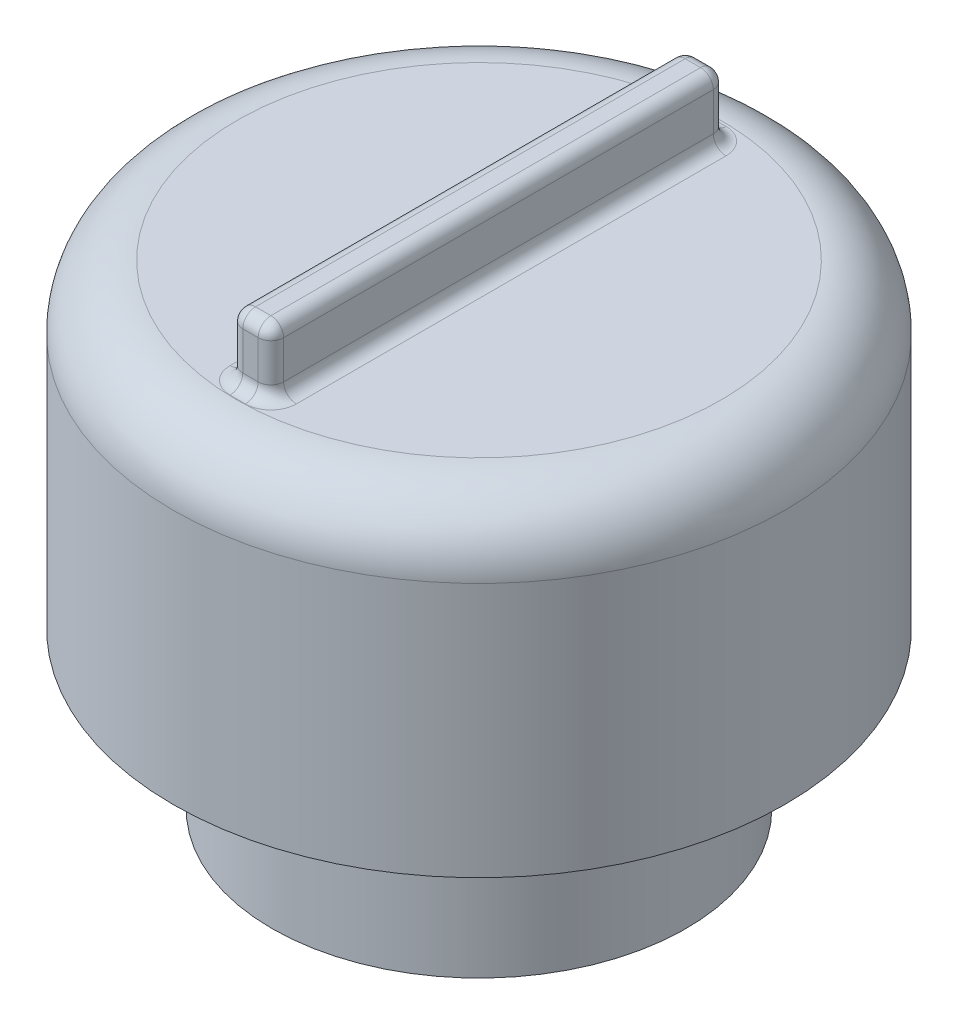
ISO-10303-21;
HEADER;
FILE_DESCRIPTION(('STEP AP214'),'2;1');
FILE_NAME('part.step','',(''),(''),'','','');
FILE_SCHEMA(('AUTOMOTIVE_DESIGN { 1 0 10303 214 1 1 1 1 }'));
ENDSEC;
DATA;
#1=APPLICATION_CONTEXT('core data for automotive mechanical design processes');
#2=APPLICATION_PROTOCOL_DEFINITION('international standard','automotive_design',2000,#1);
#3=PRODUCT_CONTEXT('',#1,'mechanical');
#4=PRODUCT('Part','Part','',(#3));
#5=PRODUCT_RELATED_PRODUCT_CATEGORY('part','',(#4));
#6=PRODUCT_DEFINITION_FORMATION('','',#4);
#7=PRODUCT_DEFINITION_CONTEXT('part definition',#1,'design');
#8=PRODUCT_DEFINITION('design','',#6,#7);
#9=PRODUCT_DEFINITION_SHAPE('','',#8);
#10=(LENGTH_UNIT() NAMED_UNIT(*) SI_UNIT(.MILLI.,.METRE.));
#11=(NAMED_UNIT(*) PLANE_ANGLE_UNIT() SI_UNIT($,.RADIAN.));
#12=(NAMED_UNIT(*) SI_UNIT($,.STERADIAN.) SOLID_ANGLE_UNIT());
#13=UNCERTAINTY_MEASURE_WITH_UNIT(LENGTH_MEASURE(1.E-05),#10,'distance_accuracy_value','');
#14=(GEOMETRIC_REPRESENTATION_CONTEXT(3) GLOBAL_UNCERTAINTY_ASSIGNED_CONTEXT((#13)) GLOBAL_UNIT_ASSIGNED_CONTEXT((#10,
#11,#12)) REPRESENTATION_CONTEXT('',''));
#15=CARTESIAN_POINT('',(0.,0.,0.));
#16=DIRECTION('',(0.,0.,1.));
#17=DIRECTION('',(1.,0.,0.));
#18=AXIS2_PLACEMENT_3D('',#15,#16,#17);
#19=CARTESIAN_POINT('',(0.,7.46,0.));
#20=DIRECTION('',(0.,1.,0.));
#21=DIRECTION('',(0.,0.,1.));
#22=AXIS2_PLACEMENT_3D('',#19,#20,#21);
#23=PLANE('',#22);
#24=CARTESIAN_POINT('',(0.,7.46,0.));
#25=DIRECTION('',(0.,1.,0.));
#26=DIRECTION('',(0.,0.,1.));
#27=AXIS2_PLACEMENT_3D('',#24,#25,#26);
#28=CIRCLE('',#27,3.8);
#29=CARTESIAN_POINT('',(0.,7.46,3.8));
#30=VERTEX_POINT('',#29);
#31=EDGE_CURVE('E72',#30,#30,#28,.T.);
#32=ORIENTED_EDGE('',*,*,#31,.T.);
#33=EDGE_LOOP('',(#32));
#34=FACE_BOUND('',#33,.T.);
#35=CARTESIAN_POINT('',(0.120552884615385,7.46,-3.35686063388664));
#36=DIRECTION('',(0.,1.,0.));
#37=DIRECTION('',(0.,0.,1.));
#38=AXIS2_PLACEMENT_3D('',#35,#36,#37);
#39=CIRCLE('',#38,0.4);
#40=CARTESIAN_POINT('',(0.520552884615385,7.46,-3.35686063388664));
#41=VERTEX_POINT('',#40);
#42=CARTESIAN_POINT('',(0.120552884615385,7.46,-3.75686063388664));
#43=VERTEX_POINT('',#42);
#44=EDGE_CURVE('E207',#41,#43,#39,.T.);
#45=ORIENTED_EDGE('',*,*,#44,.F.);
#46=DIRECTION('',(0.,0.,1.));
#47=VECTOR('',#46,1.);
#48=CARTESIAN_POINT('',(0.520552884615385,7.46,3.58688936611336));
#49=LINE('',#48,#47);
#50=CARTESIAN_POINT('',(0.520552884615385,7.46,3.38688936611336));
#51=VERTEX_POINT('',#50);
#52=EDGE_CURVE('E199',#41,#51,#49,.T.);
#53=ORIENTED_EDGE('',*,*,#52,.T.);
#54=CARTESIAN_POINT('',(0.120552884615385,7.46,3.38688936611336));
#55=DIRECTION('',(0.,1.,0.));
#56=DIRECTION('',(0.,0.,1.));
#57=AXIS2_PLACEMENT_3D('',#54,#55,#56);
#58=CIRCLE('',#57,0.4);
#59=CARTESIAN_POINT('',(0.120552884615385,7.46,3.78688936611336));
#60=VERTEX_POINT('',#59);
#61=EDGE_CURVE('E193',#60,#51,#58,.T.);
#62=ORIENTED_EDGE('',*,*,#61,.F.);
#63=DIRECTION('',(-1.,0.,0.));
#64=VECTOR('',#63,1.);
#65=CARTESIAN_POINT('',(-0.320552884615384,7.46,3.78688936611336));
#66=LINE('',#65,#64);
#67=CARTESIAN_POINT('',(-0.120552884615384,7.46,3.78688936611336));
#68=VERTEX_POINT('',#67);
#69=EDGE_CURVE('E194',#60,#68,#66,.T.);
#70=ORIENTED_EDGE('',*,*,#69,.T.);
#71=CARTESIAN_POINT('',(-0.120552884615384,7.46,3.38688936611336));
#72=DIRECTION('',(0.,1.,0.));
#73=DIRECTION('',(0.,0.,1.));
#74=AXIS2_PLACEMENT_3D('',#71,#72,#73);
#75=CIRCLE('',#74,0.4);
#76=CARTESIAN_POINT('',(-0.520552884615384,7.46,3.38688936611336));
#77=VERTEX_POINT('',#76);
#78=EDGE_CURVE('E201',#77,#68,#75,.T.);
#79=ORIENTED_EDGE('',*,*,#78,.F.);
#80=DIRECTION('',(0.,0.,-1.));
#81=VECTOR('',#80,1.);
#82=CARTESIAN_POINT('',(-0.520552884615384,7.46,-3.55686063388664));
#83=LINE('',#82,#81);
#84=CARTESIAN_POINT('',(-0.520552884615384,7.46,-3.35686063388664));
#85=VERTEX_POINT('',#84);
#86=EDGE_CURVE('E170',#77,#85,#83,.T.);
#87=ORIENTED_EDGE('',*,*,#86,.T.);
#88=CARTESIAN_POINT('',(-0.120552884615384,7.46,-3.35686063388664));
#89=DIRECTION('',(0.,1.,0.));
#90=DIRECTION('',(0.,0.,1.));
#91=AXIS2_PLACEMENT_3D('',#88,#89,#90);
#92=CIRCLE('',#91,0.4);
#93=CARTESIAN_POINT('',(-0.120552884615384,7.46,-3.75686063388664));
#94=VERTEX_POINT('',#93);
#95=EDGE_CURVE('E165',#94,#85,#92,.T.);
#96=ORIENTED_EDGE('',*,*,#95,.F.);
#97=DIRECTION('',(1.,0.,0.));
#98=VECTOR('',#97,1.);
#99=CARTESIAN_POINT('',(0.320552884615385,7.46,-3.75686063388664));
#100=LINE('',#99,#98);
#101=EDGE_CURVE('E168',#94,#43,#100,.T.);
#102=ORIENTED_EDGE('',*,*,#101,.T.);
#103=EDGE_LOOP('',(#45,#53,#62,#70,#79,#87,#96,#102));
#104=FACE_BOUND('',#103,.T.);
#105=ADVANCED_FACE('F63',(#34,#104),#23,.T.);
#106=CARTESIAN_POINT('',(0.,2.46,0.));
#107=DIRECTION('',(0.,-1.,0.));
#108=DIRECTION('',(0.,0.,-1.));
#109=AXIS2_PLACEMENT_3D('',#106,#107,#108);
#110=CYLINDRICAL_SURFACE('',#109,3.25);
#111=CARTESIAN_POINT('',(0.,2.46,0.));
#112=DIRECTION('',(0.,1.,0.));
#113=DIRECTION('',(0.,0.,1.));
#114=AXIS2_PLACEMENT_3D('',#111,#112,#113);
#115=CIRCLE('',#114,3.25);
#116=CARTESIAN_POINT('',(0.,2.46,3.25));
#117=VERTEX_POINT('',#116);
#118=EDGE_CURVE('E175',#117,#117,#115,.T.);
#119=ORIENTED_EDGE('',*,*,#118,.F.);
#120=EDGE_LOOP('',(#119));
#121=FACE_BOUND('',#120,.T.);
#122=CARTESIAN_POINT('',(0.,0.,0.));
#123=DIRECTION('',(0.,1.,0.));
#124=DIRECTION('',(0.,0.,1.));
#125=AXIS2_PLACEMENT_3D('',#122,#123,#124);
#126=CIRCLE('',#125,3.25);
#127=CARTESIAN_POINT('',(0.,0.,3.25));
#128=VERTEX_POINT('',#127);
#129=EDGE_CURVE('E519',#128,#128,#126,.T.);
#130=ORIENTED_EDGE('',*,*,#129,.T.);
#131=EDGE_LOOP('',(#130));
#132=FACE_BOUND('',#131,.T.);
#133=ADVANCED_FACE('F371',(#121,#132),#110,.T.);
#134=CARTESIAN_POINT('',(0.,0.,0.));
#135=DIRECTION('',(0.,1.,0.));
#136=DIRECTION('',(0.,0.,1.));
#137=AXIS2_PLACEMENT_3D('',#134,#135,#136);
#138=PLANE('',#137);
#139=CARTESIAN_POINT('',(0.,0.,0.));
#140=DIRECTION('',(0.,-1.,0.));
#141=DIRECTION('',(0.,0.,-1.));
#142=AXIS2_PLACEMENT_3D('',#139,#140,#141);
#143=CIRCLE('',#142,1.75);
#144=CARTESIAN_POINT('',(0.,0.,-1.75));
#145=VERTEX_POINT('',#144);
#146=EDGE_CURVE('E523',#145,#145,#143,.T.);
#147=ORIENTED_EDGE('',*,*,#146,.F.);
#148=EDGE_LOOP('',(#147));
#149=FACE_BOUND('',#148,.T.);
#150=ORIENTED_EDGE('',*,*,#129,.F.);
#151=EDGE_LOOP('',(#150));
#152=FACE_BOUND('',#151,.T.);
#153=ADVANCED_FACE('F376',(#149,#152),#138,.F.);
#154=CARTESIAN_POINT('',(0.,2.5,0.));
#155=DIRECTION('',(0.,-1.,0.));
#156=DIRECTION('',(0.,0.,-1.));
#157=AXIS2_PLACEMENT_3D('',#154,#155,#156);
#158=CYLINDRICAL_SURFACE('',#157,1.75);
#159=CARTESIAN_POINT('',(0.,2.46,0.));
#160=DIRECTION('',(0.,1.,0.));
#161=DIRECTION('',(0.,0.,1.));
#162=AXIS2_PLACEMENT_3D('',#159,#160,#161);
#163=CIRCLE('',#162,1.75);
#164=CARTESIAN_POINT('',(0.,2.46,1.75));
#165=VERTEX_POINT('',#164);
#166=EDGE_CURVE('E527',#165,#165,#163,.T.);
#167=ORIENTED_EDGE('',*,*,#166,.T.);
#168=EDGE_LOOP('',(#167));
#169=FACE_BOUND('',#168,.T.);
#170=ORIENTED_EDGE('',*,*,#146,.T.);
#171=EDGE_LOOP('',(#170));
#172=FACE_BOUND('',#171,.T.);
#173=ADVANCED_FACE('F387',(#169,#172),#158,.F.);
#174=CARTESIAN_POINT('',(0.,2.46,0.));
#175=DIRECTION('',(0.,1.,0.));
#176=DIRECTION('',(0.,0.,1.));
#177=AXIS2_PLACEMENT_3D('',#174,#175,#176);
#178=PLANE('',#177);
#179=ORIENTED_EDGE('',*,*,#118,.T.);
#180=EDGE_LOOP('',(#179));
#181=FACE_BOUND('',#180,.T.);
#182=CARTESIAN_POINT('',(0.,2.46,0.));
#183=DIRECTION('',(0.,1.,0.));
#184=DIRECTION('',(0.,0.,1.));
#185=AXIS2_PLACEMENT_3D('',#182,#183,#184);
#186=CIRCLE('',#185,4.8);
#187=CARTESIAN_POINT('',(0.,2.46,4.8));
#188=VERTEX_POINT('',#187);
#189=EDGE_CURVE('E355',#188,#188,#186,.T.);
#190=ORIENTED_EDGE('',*,*,#189,.F.);
#191=EDGE_LOOP('',(#190));
#192=FACE_BOUND('',#191,.T.);
#193=ADVANCED_FACE('F383',(#181,#192),#178,.F.);
#194=CARTESIAN_POINT('',(0.,7.46,0.));
#195=DIRECTION('',(0.,-1.,0.));
#196=DIRECTION('',(0.,0.,-1.));
#197=AXIS2_PLACEMENT_3D('',#194,#195,#196);
#198=CYLINDRICAL_SURFACE('',#197,4.8);
#199=CARTESIAN_POINT('',(0.,6.46,0.));
#200=DIRECTION('',(0.,1.,0.));
#201=DIRECTION('',(0.,0.,1.));
#202=AXIS2_PLACEMENT_3D('',#199,#200,#201);
#203=CIRCLE('',#202,4.8);
#204=CARTESIAN_POINT('',(0.,6.46,4.8));
#205=VERTEX_POINT('',#204);
#206=EDGE_CURVE('E12',#205,#205,#203,.F.);
#207=ORIENTED_EDGE('',*,*,#206,.T.);
#208=EDGE_LOOP('',(#207));
#209=FACE_BOUND('',#208,.T.);
#210=ORIENTED_EDGE('',*,*,#189,.T.);
#211=EDGE_LOOP('',(#210));
#212=FACE_BOUND('',#211,.T.);
#213=ADVANCED_FACE('F386',(#209,#212),#198,.T.);
#214=ORIENTED_EDGE('',*,*,#166,.F.);
#215=EDGE_LOOP('',(#214));
#216=FACE_BOUND('',#215,.T.);
#217=ADVANCED_FACE('F389',(#216),#178,.F.);
#218=CARTESIAN_POINT('',(-0.320552884615384,8.46,3.58688936611336));
#219=DIRECTION('',(-1.,0.,0.));
#220=DIRECTION('',(0.,0.,1.));
#221=AXIS2_PLACEMENT_3D('',#218,#219,#220);
#222=PLANE('',#221);
#223=DIRECTION('',(0.,0.,-1.));
#224=VECTOR('',#223,1.);
#225=CARTESIAN_POINT('',(-0.320552884615384,7.66,3.58688936611336));
#226=LINE('',#225,#224);
#227=CARTESIAN_POINT('',(-0.320552884615384,7.66,-3.35686063388664));
#228=VERTEX_POINT('',#227);
#229=CARTESIAN_POINT('',(-0.320552884615384,7.66,3.38688936611336));
#230=VERTEX_POINT('',#229);
#231=EDGE_CURVE('E236',#228,#230,#226,.F.);
#232=ORIENTED_EDGE('',*,*,#231,.T.);
#233=DIRECTION('',(0.,-1.,0.));
#234=VECTOR('',#233,1.);
#235=CARTESIAN_POINT('',(-0.320552884615384,8.46,3.38688936611336));
#236=LINE('',#235,#234);
#237=CARTESIAN_POINT('',(-0.320552884615384,8.26,3.38688936611336));
#238=VERTEX_POINT('',#237);
#239=EDGE_CURVE('E245',#230,#238,#236,.F.);
#240=ORIENTED_EDGE('',*,*,#239,.T.);
#241=DIRECTION('',(0.,0.,-1.));
#242=VECTOR('',#241,1.);
#243=CARTESIAN_POINT('',(-0.320552884615384,8.26,-3.55686063388664));
#244=LINE('',#243,#242);
#245=CARTESIAN_POINT('',(-0.320552884615384,8.26,-3.35686063388664));
#246=VERTEX_POINT('',#245);
#247=EDGE_CURVE('E242',#238,#246,#244,.T.);
#248=ORIENTED_EDGE('',*,*,#247,.T.);
#249=DIRECTION('',(0.,-1.,0.));
#250=VECTOR('',#249,1.);
#251=CARTESIAN_POINT('',(-0.320552884615384,8.46,-3.35686063388664));
#252=LINE('',#251,#250);
#253=EDGE_CURVE('E239',#246,#228,#252,.T.);
#254=ORIENTED_EDGE('',*,*,#253,.T.);
#255=EDGE_LOOP('',(#232,#240,#248,#254));
#256=FACE_BOUND('',#255,.T.);
#257=ADVANCED_FACE('F381',(#256),#222,.T.);
#258=CARTESIAN_POINT('',(0.320552884615385,8.46,3.58688936611336));
#259=DIRECTION('',(0.,0.,1.));
#260=DIRECTION('',(1.,0.,0.));
#261=AXIS2_PLACEMENT_3D('',#258,#259,#260);
#262=PLANE('',#261);
#263=DIRECTION('',(-1.,0.,0.));
#264=VECTOR('',#263,1.);
#265=CARTESIAN_POINT('',(-0.320552884615384,8.26,3.58688936611336));
#266=LINE('',#265,#264);
#267=CARTESIAN_POINT('',(0.120552884615385,8.26,3.58688936611336));
#268=VERTEX_POINT('',#267);
#269=CARTESIAN_POINT('',(-0.120552884615384,8.26,3.58688936611336));
#270=VERTEX_POINT('',#269);
#271=EDGE_CURVE('E223',#268,#270,#266,.T.);
#272=ORIENTED_EDGE('',*,*,#271,.T.);
#273=DIRECTION('',(0.,-1.,0.));
#274=VECTOR('',#273,1.);
#275=CARTESIAN_POINT('',(-0.120552884615384,8.46,3.58688936611336));
#276=LINE('',#275,#274);
#277=CARTESIAN_POINT('',(-0.120552884615384,7.66,3.58688936611336));
#278=VERTEX_POINT('',#277);
#279=EDGE_CURVE('E232',#270,#278,#276,.T.);
#280=ORIENTED_EDGE('',*,*,#279,.T.);
#281=DIRECTION('',(-1.,0.,0.));
#282=VECTOR('',#281,1.);
#283=CARTESIAN_POINT('',(0.320552884615385,7.66,3.58688936611336));
#284=LINE('',#283,#282);
#285=CARTESIAN_POINT('',(0.120552884615385,7.66,3.58688936611336));
#286=VERTEX_POINT('',#285);
#287=EDGE_CURVE('E229',#278,#286,#284,.F.);
#288=ORIENTED_EDGE('',*,*,#287,.T.);
#289=DIRECTION('',(0.,-1.,0.));
#290=VECTOR('',#289,1.);
#291=CARTESIAN_POINT('',(0.120552884615385,8.46,3.58688936611336));
#292=LINE('',#291,#290);
#293=EDGE_CURVE('E226',#286,#268,#292,.F.);
#294=ORIENTED_EDGE('',*,*,#293,.T.);
#295=EDGE_LOOP('',(#272,#280,#288,#294));
#296=FACE_BOUND('',#295,.T.);
#297=ADVANCED_FACE('F484',(#296),#262,.T.);
#298=CARTESIAN_POINT('',(0.320552884615385,8.46,-3.55686063388664));
#299=DIRECTION('',(1.,0.,0.));
#300=DIRECTION('',(0.,0.,-1.));
#301=AXIS2_PLACEMENT_3D('',#298,#299,#300);
#302=PLANE('',#301);
#303=DIRECTION('',(0.,-1.,0.));
#304=VECTOR('',#303,1.);
#305=CARTESIAN_POINT('',(0.320552884615385,8.46,3.38688936611336));
#306=LINE('',#305,#304);
#307=CARTESIAN_POINT('',(0.320552884615385,8.26,3.38688936611336));
#308=VERTEX_POINT('',#307);
#309=CARTESIAN_POINT('',(0.320552884615385,7.66,3.38688936611336));
#310=VERTEX_POINT('',#309);
#311=EDGE_CURVE('E255',#308,#310,#306,.T.);
#312=ORIENTED_EDGE('',*,*,#311,.T.);
#313=DIRECTION('',(0.,0.,1.));
#314=VECTOR('',#313,1.);
#315=CARTESIAN_POINT('',(0.320552884615385,7.66,-3.55686063388664));
#316=LINE('',#315,#314);
#317=CARTESIAN_POINT('',(0.320552884615385,7.66,-3.35686063388664));
#318=VERTEX_POINT('',#317);
#319=EDGE_CURVE('E259',#310,#318,#316,.F.);
#320=ORIENTED_EDGE('',*,*,#319,.T.);
#321=DIRECTION('',(0.,-1.,0.));
#322=VECTOR('',#321,1.);
#323=CARTESIAN_POINT('',(0.320552884615385,8.46,-3.35686063388664));
#324=LINE('',#323,#322);
#325=CARTESIAN_POINT('',(0.320552884615385,8.26,-3.35686063388664));
#326=VERTEX_POINT('',#325);
#327=EDGE_CURVE('E252',#318,#326,#324,.F.);
#328=ORIENTED_EDGE('',*,*,#327,.T.);
#329=DIRECTION('',(0.,0.,1.));
#330=VECTOR('',#329,1.);
#331=CARTESIAN_POINT('',(0.320552884615385,8.26,3.58688936611336));
#332=LINE('',#331,#330);
#333=EDGE_CURVE('E249',#326,#308,#332,.T.);
#334=ORIENTED_EDGE('',*,*,#333,.T.);
#335=EDGE_LOOP('',(#312,#320,#328,#334));
#336=FACE_BOUND('',#335,.T.);
#337=ADVANCED_FACE('F497',(#336),#302,.T.);
#338=CARTESIAN_POINT('',(-0.320552884615384,8.46,-3.55686063388664));
#339=DIRECTION('',(0.,0.,-1.));
#340=DIRECTION('',(-1.,0.,0.));
#341=AXIS2_PLACEMENT_3D('',#338,#339,#340);
#342=PLANE('',#341);
#343=DIRECTION('',(0.,-1.,0.));
#344=VECTOR('',#343,1.);
#345=CARTESIAN_POINT('',(0.120552884615385,8.46,-3.55686063388664));
#346=LINE('',#345,#344);
#347=CARTESIAN_POINT('',(0.120552884615385,8.26,-3.55686063388664));
#348=VERTEX_POINT('',#347);
#349=CARTESIAN_POINT('',(0.120552884615385,7.66,-3.55686063388664));
#350=VERTEX_POINT('',#349);
#351=EDGE_CURVE('E216',#348,#350,#346,.T.);
#352=ORIENTED_EDGE('',*,*,#351,.T.);
#353=DIRECTION('',(1.,0.,0.));
#354=VECTOR('',#353,1.);
#355=CARTESIAN_POINT('',(-0.320552884615384,7.66,-3.55686063388664));
#356=LINE('',#355,#354);
#357=CARTESIAN_POINT('',(-0.120552884615384,7.66,-3.55686063388664));
#358=VERTEX_POINT('',#357);
#359=EDGE_CURVE('E219',#350,#358,#356,.F.);
#360=ORIENTED_EDGE('',*,*,#359,.T.);
#361=DIRECTION('',(0.,-1.,0.));
#362=VECTOR('',#361,1.);
#363=CARTESIAN_POINT('',(-0.120552884615384,8.46,-3.55686063388664));
#364=LINE('',#363,#362);
#365=CARTESIAN_POINT('',(-0.120552884615384,8.26,-3.55686063388664));
#366=VERTEX_POINT('',#365);
#367=EDGE_CURVE('E210',#358,#366,#364,.F.);
#368=ORIENTED_EDGE('',*,*,#367,.T.);
#369=DIRECTION('',(1.,0.,0.));
#370=VECTOR('',#369,1.);
#371=CARTESIAN_POINT('',(0.320552884615385,8.26,-3.55686063388664));
#372=LINE('',#371,#370);
#373=EDGE_CURVE('E213',#366,#348,#372,.T.);
#374=ORIENTED_EDGE('',*,*,#373,.T.);
#375=EDGE_LOOP('',(#352,#360,#368,#374));
#376=FACE_BOUND('',#375,.T.);
#377=ADVANCED_FACE('F473',(#376),#342,.T.);
#378=CARTESIAN_POINT('',(0.,8.46,0.));
#379=DIRECTION('',(0.,-1.,0.));
#380=DIRECTION('',(0.,0.,-1.));
#381=AXIS2_PLACEMENT_3D('',#378,#379,#380);
#382=PLANE('',#381);
#383=DIRECTION('',(0.,0.,1.));
#384=VECTOR('',#383,1.);
#385=CARTESIAN_POINT('',(0.120552884615385,8.46,-3.55686063388664));
#386=LINE('',#385,#384);
#387=CARTESIAN_POINT('',(0.120552884615385,8.46,3.38688936611336));
#388=VERTEX_POINT('',#387);
#389=CARTESIAN_POINT('',(0.120552884615385,8.46,-3.35686063388664));
#390=VERTEX_POINT('',#389);
#391=EDGE_CURVE('E79',#388,#390,#386,.F.);
#392=ORIENTED_EDGE('',*,*,#391,.T.);
#393=DIRECTION('',(1.,0.,0.));
#394=VECTOR('',#393,1.);
#395=CARTESIAN_POINT('',(-0.320552884615384,8.46,-3.35686063388664));
#396=LINE('',#395,#394);
#397=CARTESIAN_POINT('',(-0.120552884615384,8.46,-3.35686063388664));
#398=VERTEX_POINT('',#397);
#399=EDGE_CURVE('E269',#390,#398,#396,.F.);
#400=ORIENTED_EDGE('',*,*,#399,.T.);
#401=DIRECTION('',(0.,0.,-1.));
#402=VECTOR('',#401,1.);
#403=CARTESIAN_POINT('',(-0.120552884615384,8.46,3.58688936611336));
#404=LINE('',#403,#402);
#405=CARTESIAN_POINT('',(-0.120552884615384,8.46,3.38688936611336));
#406=VERTEX_POINT('',#405);
#407=EDGE_CURVE('E262',#398,#406,#404,.F.);
#408=ORIENTED_EDGE('',*,*,#407,.T.);
#409=DIRECTION('',(-1.,0.,0.));
#410=VECTOR('',#409,1.);
#411=CARTESIAN_POINT('',(0.320552884615385,8.46,3.38688936611336));
#412=LINE('',#411,#410);
#413=EDGE_CURVE('E84',#406,#388,#412,.F.);
#414=ORIENTED_EDGE('',*,*,#413,.T.);
#415=EDGE_LOOP('',(#392,#400,#408,#414));
#416=FACE_BOUND('',#415,.T.);
#417=ADVANCED_FACE('F468',(#416),#382,.F.);
#418=CARTESIAN_POINT('',(0.320552884615385,8.26,3.38688936611336));
#419=DIRECTION('',(1.,0.,0.));
#420=DIRECTION('',(0.,0.,-1.));
#421=AXIS2_PLACEMENT_3D('',#418,#419,#420);
#422=CYLINDRICAL_SURFACE('',#421,0.2);
#423=CARTESIAN_POINT('',(-0.120552884615384,8.26,3.38688936611336));
#424=DIRECTION('',(-1.,0.,0.));
#425=DIRECTION('',(0.,-1.,0.));
#426=AXIS2_PLACEMENT_3D('',#423,#424,#425);
#427=CIRCLE('',#426,0.2);
#428=EDGE_CURVE('E352',#270,#406,#427,.T.);
#429=ORIENTED_EDGE('',*,*,#428,.F.);
#430=ORIENTED_EDGE('',*,*,#271,.F.);
#431=CARTESIAN_POINT('',(0.120552884615385,8.26,3.38688936611336));
#432=DIRECTION('',(1.,0.,0.));
#433=DIRECTION('',(0.,0.,-1.));
#434=AXIS2_PLACEMENT_3D('',#431,#432,#433);
#435=CIRCLE('',#434,0.2);
#436=EDGE_CURVE('E348',#388,#268,#435,.T.);
#437=ORIENTED_EDGE('',*,*,#436,.F.);
#438=ORIENTED_EDGE('',*,*,#413,.F.);
#439=EDGE_LOOP('',(#429,#430,#437,#438));
#440=FACE_BOUND('',#439,.T.);
#441=ADVANCED_FACE('F465',(#440),#422,.T.);
#442=CARTESIAN_POINT('',(-0.120552884615384,8.26,3.38688936611336));
#443=DIRECTION('',(0.,1.,0.));
#444=DIRECTION('',(0.,0.,1.));
#445=AXIS2_PLACEMENT_3D('',#442,#443,#444);
#446=SPHERICAL_SURFACE('',#445,0.2);
#447=CARTESIAN_POINT('',(-0.120552884615384,8.26,3.38688936611336));
#448=DIRECTION('',(0.,1.,0.));
#449=DIRECTION('',(0.,0.,1.));
#450=AXIS2_PLACEMENT_3D('',#447,#448,#449);
#451=CIRCLE('',#450,0.2);
#452=EDGE_CURVE('E340',#270,#238,#451,.F.);
#453=ORIENTED_EDGE('',*,*,#452,.F.);
#454=ORIENTED_EDGE('',*,*,#428,.T.);
#455=CARTESIAN_POINT('',(-0.120552884615384,8.26,3.38688936611336));
#456=DIRECTION('',(0.,0.,1.));
#457=DIRECTION('',(1.,0.,0.));
#458=AXIS2_PLACEMENT_3D('',#455,#456,#457);
#459=CIRCLE('',#458,0.2);
#460=EDGE_CURVE('E344',#238,#406,#459,.F.);
#461=ORIENTED_EDGE('',*,*,#460,.F.);
#462=EDGE_LOOP('',(#453,#454,#461));
#463=FACE_BOUND('',#462,.T.);
#464=ADVANCED_FACE('F462',(#463),#446,.T.);
#465=CARTESIAN_POINT('',(0.120552884615385,8.26,3.38688936611336));
#466=DIRECTION('',(0.,0.,1.));
#467=DIRECTION('',(1.,0.,0.));
#468=AXIS2_PLACEMENT_3D('',#465,#466,#467);
#469=SPHERICAL_SURFACE('',#468,0.2);
#470=CARTESIAN_POINT('',(0.120552884615385,8.26,3.38688936611336));
#471=DIRECTION('',(0.,0.,1.));
#472=DIRECTION('',(0.,-1.,0.));
#473=AXIS2_PLACEMENT_3D('',#470,#471,#472);
#474=CIRCLE('',#473,0.2);
#475=EDGE_CURVE('E332',#388,#308,#474,.F.);
#476=ORIENTED_EDGE('',*,*,#475,.F.);
#477=ORIENTED_EDGE('',*,*,#436,.T.);
#478=CARTESIAN_POINT('',(0.120552884615385,8.26,3.38688936611336));
#479=DIRECTION('',(0.,1.,0.));
#480=DIRECTION('',(0.,0.,1.));
#481=AXIS2_PLACEMENT_3D('',#478,#479,#480);
#482=CIRCLE('',#481,0.2);
#483=EDGE_CURVE('E336',#308,#268,#482,.F.);
#484=ORIENTED_EDGE('',*,*,#483,.F.);
#485=EDGE_LOOP('',(#476,#477,#484));
#486=FACE_BOUND('',#485,.T.);
#487=ADVANCED_FACE('F458',(#486),#469,.T.);
#488=CARTESIAN_POINT('',(-0.120552884615384,8.26,3.58688936611336));
#489=DIRECTION('',(0.,0.,1.));
#490=DIRECTION('',(1.,0.,0.));
#491=AXIS2_PLACEMENT_3D('',#488,#489,#490);
#492=CYLINDRICAL_SURFACE('',#491,0.2);
#493=ORIENTED_EDGE('',*,*,#460,.T.);
#494=ORIENTED_EDGE('',*,*,#407,.F.);
#495=CARTESIAN_POINT('',(-0.120552884615384,8.26,-3.35686063388664));
#496=DIRECTION('',(0.,0.,-1.));
#497=DIRECTION('',(0.,1.,0.));
#498=AXIS2_PLACEMENT_3D('',#495,#496,#497);
#499=CIRCLE('',#498,0.2);
#500=EDGE_CURVE('E325',#246,#398,#499,.T.);
#501=ORIENTED_EDGE('',*,*,#500,.F.);
#502=ORIENTED_EDGE('',*,*,#247,.F.);
#503=EDGE_LOOP('',(#493,#494,#501,#502));
#504=FACE_BOUND('',#503,.T.);
#505=ADVANCED_FACE('F454',(#504),#492,.T.);
#506=CARTESIAN_POINT('',(-0.120552884615384,8.46,3.38688936611336));
#507=DIRECTION('',(0.,-1.,0.));
#508=DIRECTION('',(0.,0.,-1.));
#509=AXIS2_PLACEMENT_3D('',#506,#507,#508);
#510=CYLINDRICAL_SURFACE('',#509,0.2);
#511=ORIENTED_EDGE('',*,*,#452,.T.);
#512=ORIENTED_EDGE('',*,*,#239,.F.);
#513=CARTESIAN_POINT('',(-0.120552884615384,7.66,3.38688936611336));
#514=DIRECTION('',(0.,1.,0.));
#515=DIRECTION('',(0.,0.,1.));
#516=AXIS2_PLACEMENT_3D('',#513,#514,#515);
#517=CIRCLE('',#516,0.2);
#518=EDGE_CURVE('E321',#278,#230,#517,.F.);
#519=ORIENTED_EDGE('',*,*,#518,.F.);
#520=ORIENTED_EDGE('',*,*,#279,.F.);
#521=EDGE_LOOP('',(#511,#512,#519,#520));
#522=FACE_BOUND('',#521,.T.);
#523=ADVANCED_FACE('F450',(#522),#510,.T.);
#524=CARTESIAN_POINT('',(0.,7.66,3.78688936611336));
#525=DIRECTION('',(1.,0.,0.));
#526=DIRECTION('',(0.,0.,-1.));
#527=AXIS2_PLACEMENT_3D('',#524,#525,#526);
#528=CYLINDRICAL_SURFACE('',#527,0.2);
#529=CARTESIAN_POINT('',(0.120552884615385,7.66,3.78688936611336));
#530=DIRECTION('',(-1.,0.,0.));
#531=DIRECTION('',(0.,0.,1.));
#532=AXIS2_PLACEMENT_3D('',#529,#530,#531);
#533=CIRCLE('',#532,0.2);
#534=EDGE_CURVE('E314',#286,#60,#533,.T.);
#535=ORIENTED_EDGE('',*,*,#534,.F.);
#536=ORIENTED_EDGE('',*,*,#287,.F.);
#537=CARTESIAN_POINT('',(-0.120552884615384,7.66,3.78688936611336));
#538=DIRECTION('',(1.,0.,0.));
#539=DIRECTION('',(0.,0.,-1.));
#540=AXIS2_PLACEMENT_3D('',#537,#538,#539);
#541=CIRCLE('',#540,0.2);
#542=EDGE_CURVE('E318',#68,#278,#541,.T.);
#543=ORIENTED_EDGE('',*,*,#542,.F.);
#544=ORIENTED_EDGE('',*,*,#69,.F.);
#545=EDGE_LOOP('',(#535,#536,#543,#544));
#546=FACE_BOUND('',#545,.T.);
#547=ADVANCED_FACE('F446',(#546),#528,.F.);
#548=CARTESIAN_POINT('',(0.120552884615385,8.46,3.38688936611336));
#549=DIRECTION('',(0.,-1.,0.));
#550=DIRECTION('',(0.,0.,-1.));
#551=AXIS2_PLACEMENT_3D('',#548,#549,#550);
#552=CYLINDRICAL_SURFACE('',#551,0.2);
#553=ORIENTED_EDGE('',*,*,#483,.T.);
#554=ORIENTED_EDGE('',*,*,#293,.F.);
#555=CARTESIAN_POINT('',(0.120552884615385,7.66,3.38688936611336));
#556=DIRECTION('',(0.,1.,0.));
#557=DIRECTION('',(0.,0.,1.));
#558=AXIS2_PLACEMENT_3D('',#555,#556,#557);
#559=CIRCLE('',#558,0.2);
#560=EDGE_CURVE('E310',#310,#286,#559,.F.);
#561=ORIENTED_EDGE('',*,*,#560,.F.);
#562=ORIENTED_EDGE('',*,*,#311,.F.);
#563=EDGE_LOOP('',(#553,#554,#561,#562));
#564=FACE_BOUND('',#563,.T.);
#565=ADVANCED_FACE('F442',(#564),#552,.T.);
#566=CARTESIAN_POINT('',(0.120552884615385,8.26,-3.55686063388664));
#567=DIRECTION('',(0.,0.,-1.));
#568=DIRECTION('',(-1.,0.,0.));
#569=AXIS2_PLACEMENT_3D('',#566,#567,#568);
#570=CYLINDRICAL_SURFACE('',#569,0.2);
#571=ORIENTED_EDGE('',*,*,#475,.T.);
#572=ORIENTED_EDGE('',*,*,#333,.F.);
#573=CARTESIAN_POINT('',(0.120552884615385,8.26,-3.35686063388664));
#574=DIRECTION('',(0.,0.,-1.));
#575=DIRECTION('',(-1.,0.,0.));
#576=AXIS2_PLACEMENT_3D('',#573,#574,#575);
#577=CIRCLE('',#576,0.2);
#578=EDGE_CURVE('E306',#390,#326,#577,.T.);
#579=ORIENTED_EDGE('',*,*,#578,.F.);
#580=ORIENTED_EDGE('',*,*,#391,.F.);
#581=EDGE_LOOP('',(#571,#572,#579,#580));
#582=FACE_BOUND('',#581,.T.);
#583=ADVANCED_FACE('F438',(#582),#570,.T.);
#584=CARTESIAN_POINT('',(-0.320552884615384,8.26,-3.35686063388664));
#585=DIRECTION('',(-1.,0.,0.));
#586=DIRECTION('',(0.,0.,1.));
#587=AXIS2_PLACEMENT_3D('',#584,#585,#586);
#588=CYLINDRICAL_SURFACE('',#587,0.2);
#589=CARTESIAN_POINT('',(-0.120552884615384,8.26,-3.35686063388664));
#590=DIRECTION('',(-1.,0.,0.));
#591=DIRECTION('',(0.,0.,1.));
#592=AXIS2_PLACEMENT_3D('',#589,#590,#591);
#593=CIRCLE('',#592,0.2);
#594=EDGE_CURVE('E328',#398,#366,#593,.T.);
#595=ORIENTED_EDGE('',*,*,#594,.F.);
#596=ORIENTED_EDGE('',*,*,#399,.F.);
#597=CARTESIAN_POINT('',(0.120552884615385,8.26,-3.35686063388664));
#598=DIRECTION('',(1.,0.,0.));
#599=DIRECTION('',(0.,1.,0.));
#600=AXIS2_PLACEMENT_3D('',#597,#598,#599);
#601=CIRCLE('',#600,0.2);
#602=EDGE_CURVE('E302',#348,#390,#601,.T.);
#603=ORIENTED_EDGE('',*,*,#602,.F.);
#604=ORIENTED_EDGE('',*,*,#373,.F.);
#605=EDGE_LOOP('',(#595,#596,#603,#604));
#606=FACE_BOUND('',#605,.T.);
#607=ADVANCED_FACE('F434',(#606),#588,.T.);
#608=CARTESIAN_POINT('',(-0.120552884615384,8.26,-3.35686063388664));
#609=DIRECTION('',(0.,1.,0.));
#610=DIRECTION('',(0.,0.,1.));
#611=AXIS2_PLACEMENT_3D('',#608,#609,#610);
#612=SPHERICAL_SURFACE('',#611,0.2);
#613=ORIENTED_EDGE('',*,*,#500,.T.);
#614=ORIENTED_EDGE('',*,*,#594,.T.);
#615=CARTESIAN_POINT('',(-0.120552884615384,8.26,-3.35686063388664));
#616=DIRECTION('',(0.,1.,0.));
#617=DIRECTION('',(0.,0.,1.));
#618=AXIS2_PLACEMENT_3D('',#615,#616,#617);
#619=CIRCLE('',#618,0.2);
#620=EDGE_CURVE('E298',#246,#366,#619,.F.);
#621=ORIENTED_EDGE('',*,*,#620,.F.);
#622=EDGE_LOOP('',(#613,#614,#621));
#623=FACE_BOUND('',#622,.T.);
#624=ADVANCED_FACE('F430',(#623),#612,.T.);
#625=CARTESIAN_POINT('',(-0.120552884615384,7.66,3.38688936611336));
#626=DIRECTION('',(0.,1.,0.));
#627=DIRECTION('',(0.,0.,1.));
#628=AXIS2_PLACEMENT_3D('',#625,#626,#627);
#629=TOROIDAL_SURFACE('',#628,0.4,0.2);
#630=ORIENTED_EDGE('',*,*,#542,.T.);
#631=ORIENTED_EDGE('',*,*,#518,.T.);
#632=CARTESIAN_POINT('',(-0.520552884615384,7.66,3.38688936611336));
#633=DIRECTION('',(0.,0.,-1.));
#634=DIRECTION('',(-1.,0.,0.));
#635=AXIS2_PLACEMENT_3D('',#632,#633,#634);
#636=CIRCLE('',#635,0.2);
#637=EDGE_CURVE('E294',#77,#230,#636,.F.);
#638=ORIENTED_EDGE('',*,*,#637,.F.);
#639=ORIENTED_EDGE('',*,*,#78,.T.);
#640=EDGE_LOOP('',(#630,#631,#638,#639));
#641=FACE_BOUND('',#640,.T.);
#642=ADVANCED_FACE('F426',(#641),#629,.F.);
#643=CARTESIAN_POINT('',(0.120552884615385,7.66,3.38688936611336));
#644=DIRECTION('',(0.,1.,0.));
#645=DIRECTION('',(0.,0.,1.));
#646=AXIS2_PLACEMENT_3D('',#643,#644,#645);
#647=TOROIDAL_SURFACE('',#646,0.4,0.2);
#648=ORIENTED_EDGE('',*,*,#534,.T.);
#649=ORIENTED_EDGE('',*,*,#61,.T.);
#650=CARTESIAN_POINT('',(0.520552884615385,7.66,3.38688936611336));
#651=DIRECTION('',(0.,0.,-1.));
#652=DIRECTION('',(-1.,0.,0.));
#653=AXIS2_PLACEMENT_3D('',#650,#651,#652);
#654=CIRCLE('',#653,0.2);
#655=EDGE_CURVE('E290',#310,#51,#654,.F.);
#656=ORIENTED_EDGE('',*,*,#655,.F.);
#657=ORIENTED_EDGE('',*,*,#560,.T.);
#658=EDGE_LOOP('',(#648,#649,#656,#657));
#659=FACE_BOUND('',#658,.T.);
#660=ADVANCED_FACE('F422',(#659),#647,.F.);
#661=CARTESIAN_POINT('',(0.120552884615385,8.26,-3.35686063388664));
#662=DIRECTION('',(0.,1.,0.));
#663=DIRECTION('',(0.,0.,1.));
#664=AXIS2_PLACEMENT_3D('',#661,#662,#663);
#665=SPHERICAL_SURFACE('',#664,0.2);
#666=ORIENTED_EDGE('',*,*,#602,.T.);
#667=ORIENTED_EDGE('',*,*,#578,.T.);
#668=CARTESIAN_POINT('',(0.120552884615385,8.26,-3.35686063388664));
#669=DIRECTION('',(0.,1.,0.));
#670=DIRECTION('',(0.,0.,1.));
#671=AXIS2_PLACEMENT_3D('',#668,#669,#670);
#672=CIRCLE('',#671,0.2);
#673=EDGE_CURVE('E286',#348,#326,#672,.F.);
#674=ORIENTED_EDGE('',*,*,#673,.F.);
#675=EDGE_LOOP('',(#666,#667,#674));
#676=FACE_BOUND('',#675,.T.);
#677=ADVANCED_FACE('F418',(#676),#665,.T.);
#678=CARTESIAN_POINT('',(-0.120552884615384,8.46,-3.35686063388664));
#679=DIRECTION('',(0.,-1.,0.));
#680=DIRECTION('',(0.,0.,-1.));
#681=AXIS2_PLACEMENT_3D('',#678,#679,#680);
#682=CYLINDRICAL_SURFACE('',#681,0.2);
#683=ORIENTED_EDGE('',*,*,#620,.T.);
#684=ORIENTED_EDGE('',*,*,#367,.F.);
#685=CARTESIAN_POINT('',(-0.120552884615384,7.66,-3.35686063388664));
#686=DIRECTION('',(0.,1.,0.));
#687=DIRECTION('',(0.,0.,1.));
#688=AXIS2_PLACEMENT_3D('',#685,#686,#687);
#689=CIRCLE('',#688,0.2);
#690=EDGE_CURVE('E181',#228,#358,#689,.F.);
#691=ORIENTED_EDGE('',*,*,#690,.F.);
#692=ORIENTED_EDGE('',*,*,#253,.F.);
#693=EDGE_LOOP('',(#683,#684,#691,#692));
#694=FACE_BOUND('',#693,.T.);
#695=ADVANCED_FACE('F414',(#694),#682,.T.);
#696=CARTESIAN_POINT('',(-0.520552884615384,7.66,0.));
#697=DIRECTION('',(0.,0.,1.));
#698=DIRECTION('',(1.,0.,0.));
#699=AXIS2_PLACEMENT_3D('',#696,#697,#698);
#700=CYLINDRICAL_SURFACE('',#699,0.2);
#701=ORIENTED_EDGE('',*,*,#637,.T.);
#702=ORIENTED_EDGE('',*,*,#231,.F.);
#703=CARTESIAN_POINT('',(-0.520552884615384,7.66,-3.35686063388664));
#704=DIRECTION('',(0.,0.,1.));
#705=DIRECTION('',(1.,0.,0.));
#706=AXIS2_PLACEMENT_3D('',#703,#704,#705);
#707=CIRCLE('',#706,0.2);
#708=EDGE_CURVE('E281',#85,#228,#707,.T.);
#709=ORIENTED_EDGE('',*,*,#708,.F.);
#710=ORIENTED_EDGE('',*,*,#86,.F.);
#711=EDGE_LOOP('',(#701,#702,#709,#710));
#712=FACE_BOUND('',#711,.T.);
#713=ADVANCED_FACE('F410',(#712),#700,.F.);
#714=CARTESIAN_POINT('',(0.520552884615385,7.66,0.));
#715=DIRECTION('',(0.,0.,-1.));
#716=DIRECTION('',(-1.,0.,0.));
#717=AXIS2_PLACEMENT_3D('',#714,#715,#716);
#718=CYLINDRICAL_SURFACE('',#717,0.2);
#719=ORIENTED_EDGE('',*,*,#655,.T.);
#720=ORIENTED_EDGE('',*,*,#52,.F.);
#721=CARTESIAN_POINT('',(0.520552884615385,7.66,-3.35686063388664));
#722=DIRECTION('',(0.,0.,1.));
#723=DIRECTION('',(1.,0.,0.));
#724=AXIS2_PLACEMENT_3D('',#721,#722,#723);
#725=CIRCLE('',#724,0.2);
#726=EDGE_CURVE('E277',#318,#41,#725,.T.);
#727=ORIENTED_EDGE('',*,*,#726,.F.);
#728=ORIENTED_EDGE('',*,*,#319,.F.);
#729=EDGE_LOOP('',(#719,#720,#727,#728));
#730=FACE_BOUND('',#729,.T.);
#731=ADVANCED_FACE('F406',(#730),#718,.F.);
#732=CARTESIAN_POINT('',(0.120552884615385,8.46,-3.35686063388664));
#733=DIRECTION('',(0.,-1.,0.));
#734=DIRECTION('',(0.,0.,-1.));
#735=AXIS2_PLACEMENT_3D('',#732,#733,#734);
#736=CYLINDRICAL_SURFACE('',#735,0.2);
#737=ORIENTED_EDGE('',*,*,#673,.T.);
#738=ORIENTED_EDGE('',*,*,#327,.F.);
#739=CARTESIAN_POINT('',(0.120552884615385,7.66,-3.35686063388664));
#740=DIRECTION('',(0.,1.,0.));
#741=DIRECTION('',(0.,0.,1.));
#742=AXIS2_PLACEMENT_3D('',#739,#740,#741);
#743=CIRCLE('',#742,0.2);
#744=EDGE_CURVE('E186',#350,#318,#743,.F.);
#745=ORIENTED_EDGE('',*,*,#744,.F.);
#746=ORIENTED_EDGE('',*,*,#351,.F.);
#747=EDGE_LOOP('',(#737,#738,#745,#746));
#748=FACE_BOUND('',#747,.T.);
#749=ADVANCED_FACE('F403',(#748),#736,.T.);
#750=CARTESIAN_POINT('',(-0.120552884615384,7.66,-3.35686063388664));
#751=DIRECTION('',(0.,1.,0.));
#752=DIRECTION('',(0.,0.,1.));
#753=AXIS2_PLACEMENT_3D('',#750,#751,#752);
#754=TOROIDAL_SURFACE('',#753,0.4,0.2);
#755=ORIENTED_EDGE('',*,*,#708,.T.);
#756=ORIENTED_EDGE('',*,*,#690,.T.);
#757=CARTESIAN_POINT('',(-0.120552884615384,7.66,-3.75686063388664));
#758=DIRECTION('',(1.,0.,0.));
#759=DIRECTION('',(0.,0.,-1.));
#760=AXIS2_PLACEMENT_3D('',#757,#758,#759);
#761=CIRCLE('',#760,0.2);
#762=EDGE_CURVE('E178',#94,#358,#761,.F.);
#763=ORIENTED_EDGE('',*,*,#762,.F.);
#764=ORIENTED_EDGE('',*,*,#95,.T.);
#765=EDGE_LOOP('',(#755,#756,#763,#764));
#766=FACE_BOUND('',#765,.T.);
#767=ADVANCED_FACE('F179',(#766),#754,.F.);
#768=CARTESIAN_POINT('',(0.120552884615385,7.66,-3.35686063388664));
#769=DIRECTION('',(0.,1.,0.));
#770=DIRECTION('',(0.,0.,1.));
#771=AXIS2_PLACEMENT_3D('',#768,#769,#770);
#772=TOROIDAL_SURFACE('',#771,0.4,0.2);
#773=ORIENTED_EDGE('',*,*,#726,.T.);
#774=ORIENTED_EDGE('',*,*,#44,.T.);
#775=CARTESIAN_POINT('',(0.120552884615385,7.66,-3.75686063388664));
#776=DIRECTION('',(-1.,0.,0.));
#777=DIRECTION('',(0.,0.,1.));
#778=AXIS2_PLACEMENT_3D('',#775,#776,#777);
#779=CIRCLE('',#778,0.2);
#780=EDGE_CURVE('E187',#350,#43,#779,.F.);
#781=ORIENTED_EDGE('',*,*,#780,.F.);
#782=ORIENTED_EDGE('',*,*,#744,.T.);
#783=EDGE_LOOP('',(#773,#774,#781,#782));
#784=FACE_BOUND('',#783,.T.);
#785=ADVANCED_FACE('F367',(#784),#772,.F.);
#786=CARTESIAN_POINT('',(0.,7.66,-3.75686063388664));
#787=DIRECTION('',(-1.,0.,0.));
#788=DIRECTION('',(0.,0.,1.));
#789=AXIS2_PLACEMENT_3D('',#786,#787,#788);
#790=CYLINDRICAL_SURFACE('',#789,0.2);
#791=ORIENTED_EDGE('',*,*,#762,.T.);
#792=ORIENTED_EDGE('',*,*,#359,.F.);
#793=ORIENTED_EDGE('',*,*,#780,.T.);
#794=ORIENTED_EDGE('',*,*,#101,.F.);
#795=EDGE_LOOP('',(#791,#792,#793,#794));
#796=FACE_BOUND('',#795,.T.);
#797=ADVANCED_FACE('F189',(#796),#790,.F.);
#798=CARTESIAN_POINT('',(0.,6.46,0.));
#799=DIRECTION('',(0.,1.,0.));
#800=DIRECTION('',(0.,0.,1.));
#801=AXIS2_PLACEMENT_3D('',#798,#799,#800);
#802=TOROIDAL_SURFACE('',#801,3.8,1.);
#803=ORIENTED_EDGE('',*,*,#206,.F.);
#804=EDGE_LOOP('',(#803));
#805=FACE_BOUND('',#804,.T.);
#806=ORIENTED_EDGE('',*,*,#31,.F.);
#807=EDGE_LOOP('',(#806));
#808=FACE_BOUND('',#807,.T.);
#809=ADVANCED_FACE('F65',(#805,#808),#802,.T.);
#810=CLOSED_SHELL('',(#105,#133,#153,#173,#193,#213,#217,#257,#297,#337,#377,#417,#441,#464,
#487,#505,#523,#547,#565,#583,#607,#624,#642,#660,#677,#695,#713,#731,#749,#767,#785,#797,#809));
#811=MANIFOLD_SOLID_BREP('B2',#810);
#812=ADVANCED_BREP_SHAPE_REPRESENTATION('',(#18,#811),#14);
#813=SHAPE_DEFINITION_REPRESENTATION(#9,#812);
ENDSEC;
END-ISO-10303-21;
